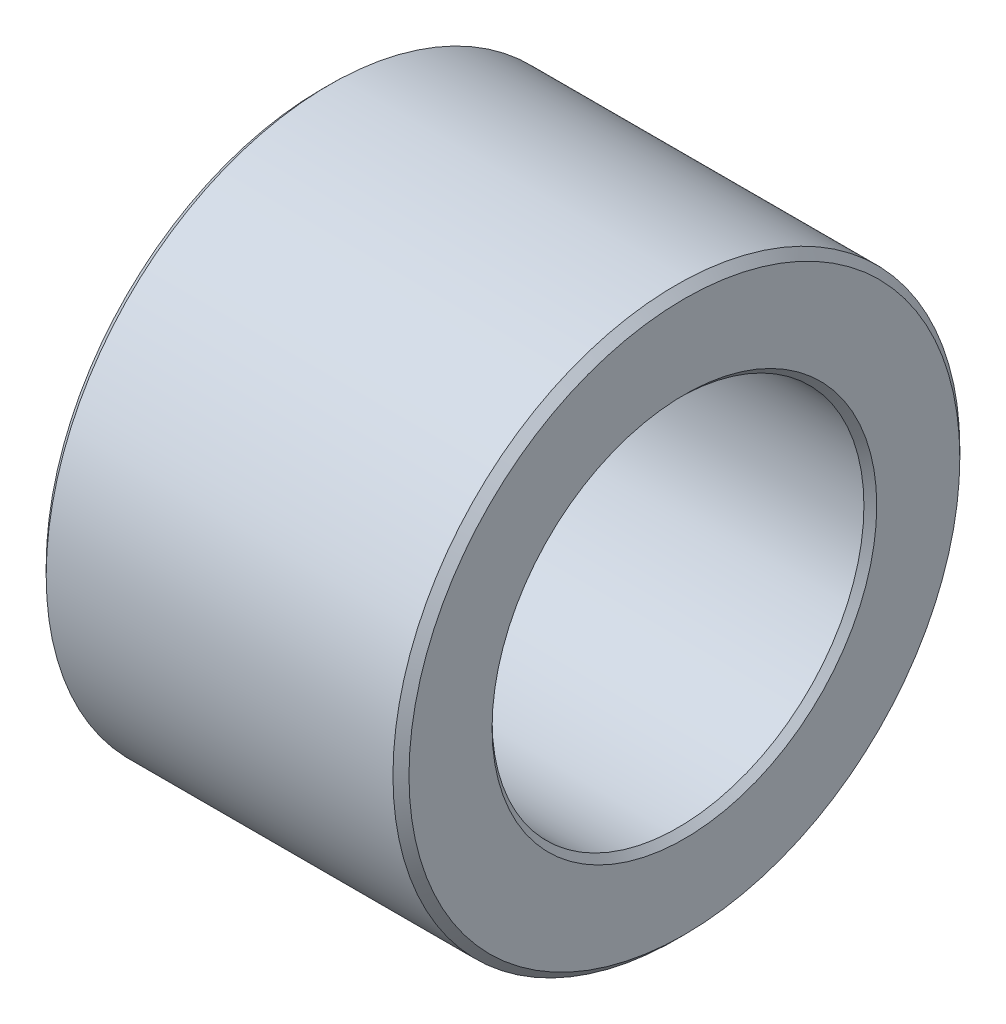
ISO-10303-21;
HEADER;
FILE_DESCRIPTION(('STEP AP214'),'2;1');
FILE_NAME('part.step','',(''),(''),'','','');
FILE_SCHEMA(('AUTOMOTIVE_DESIGN { 1 0 10303 214 1 1 1 1 }'));
ENDSEC;
DATA;
#1=APPLICATION_CONTEXT('core data for automotive mechanical design processes');
#2=APPLICATION_PROTOCOL_DEFINITION('international standard','automotive_design',2000,#1);
#3=PRODUCT_CONTEXT('',#1,'mechanical');
#4=PRODUCT('Part','Part','',(#3));
#5=PRODUCT_RELATED_PRODUCT_CATEGORY('part','',(#4));
#6=PRODUCT_DEFINITION_FORMATION('','',#4);
#7=PRODUCT_DEFINITION_CONTEXT('part definition',#1,'design');
#8=PRODUCT_DEFINITION('design','',#6,#7);
#9=PRODUCT_DEFINITION_SHAPE('','',#8);
#10=(LENGTH_UNIT() NAMED_UNIT(*) SI_UNIT(.MILLI.,.METRE.));
#11=(NAMED_UNIT(*) PLANE_ANGLE_UNIT() SI_UNIT($,.RADIAN.));
#12=(NAMED_UNIT(*) SI_UNIT($,.STERADIAN.) SOLID_ANGLE_UNIT());
#13=UNCERTAINTY_MEASURE_WITH_UNIT(LENGTH_MEASURE(1.E-05),#10,'distance_accuracy_value','');
#14=(GEOMETRIC_REPRESENTATION_CONTEXT(3) GLOBAL_UNCERTAINTY_ASSIGNED_CONTEXT((#13)) GLOBAL_UNIT_ASSIGNED_CONTEXT((#10,
#11,#12)) REPRESENTATION_CONTEXT('',''));
#15=CARTESIAN_POINT('',(0.,0.,0.));
#16=DIRECTION('',(0.,0.,1.));
#17=DIRECTION('',(1.,0.,0.));
#18=AXIS2_PLACEMENT_3D('',#15,#16,#17);
#19=CARTESIAN_POINT('',(50.,0.,0.));
#20=DIRECTION('',(-1.,0.,0.));
#21=DIRECTION('',(0.,0.,1.));
#22=AXIS2_PLACEMENT_3D('',#19,#20,#21);
#23=CYLINDRICAL_SURFACE('',#22,4.1);
#24=CARTESIAN_POINT('',(0.176776695354874,0.,0.));
#25=DIRECTION('',(-1.,0.,0.));
#26=DIRECTION('',(0.,0.,1.));
#27=AXIS2_PLACEMENT_3D('',#24,#25,#26);
#28=CIRCLE('',#27,4.099999999994);
#29=CARTESIAN_POINT('',(0.176776695354874,0.,4.099999999994));
#30=VERTEX_POINT('',#29);
#31=EDGE_CURVE('E38',#30,#30,#28,.T.);
#32=ORIENTED_EDGE('',*,*,#31,.T.);
#33=EDGE_LOOP('',(#32));
#34=FACE_BOUND('',#33,.T.);
#35=CARTESIAN_POINT('',(7.85857864383388,0.,0.));
#36=DIRECTION('',(1.,0.,0.));
#37=DIRECTION('',(0.,0.,-1.));
#38=AXIS2_PLACEMENT_3D('',#35,#36,#37);
#39=CIRCLE('',#38,4.099999999994);
#40=CARTESIAN_POINT('',(7.85857864383388,0.,-4.099999999994));
#41=VERTEX_POINT('',#40);
#42=EDGE_CURVE('E34',#41,#41,#39,.T.);
#43=ORIENTED_EDGE('',*,*,#42,.T.);
#44=EDGE_LOOP('',(#43));
#45=FACE_BOUND('',#44,.T.);
#46=ADVANCED_FACE('F15',(#34,#45),#23,.F.);
#47=CARTESIAN_POINT('',(1.13686837721616E-10,0.,0.));
#48=DIRECTION('',(-1.,0.,0.));
#49=DIRECTION('',(0.,0.,1.));
#50=AXIS2_PLACEMENT_3D('',#47,#48,#49);
#51=CONICAL_SURFACE('',#50,4.27677669523518,0.785398163397448);
#52=CARTESIAN_POINT('',(5.6843418860808E-11,0.,0.));
#53=DIRECTION('',(-1.,0.,0.));
#54=DIRECTION('',(0.,0.,1.));
#55=AXIS2_PLACEMENT_3D('',#52,#53,#54);
#56=CIRCLE('',#55,4.27677669529203);
#57=CARTESIAN_POINT('',(5.6843418860808E-11,0.,4.27677669529203));
#58=VERTEX_POINT('',#57);
#59=EDGE_CURVE('E37',#58,#58,#56,.F.);
#60=ORIENTED_EDGE('',*,*,#59,.F.);
#61=EDGE_LOOP('',(#60));
#62=FACE_BOUND('',#61,.T.);
#63=ORIENTED_EDGE('',*,*,#31,.F.);
#64=EDGE_LOOP('',(#63));
#65=FACE_BOUND('',#64,.T.);
#66=ADVANCED_FACE('F63',(#62,#65),#51,.F.);
#67=CARTESIAN_POINT('',(8.0000000000382,0.,0.));
#68=DIRECTION('',(1.,0.,0.));
#69=DIRECTION('',(0.,0.,-1.));
#70=AXIS2_PLACEMENT_3D('',#67,#68,#69);
#71=CONICAL_SURFACE('',#70,4.24142135619832,0.785398163397448);
#72=ORIENTED_EDGE('',*,*,#42,.F.);
#73=EDGE_LOOP('',(#72));
#74=FACE_BOUND('',#73,.T.);
#75=CARTESIAN_POINT('',(8.0000000000382,0.,0.));
#76=DIRECTION('',(1.,0.,0.));
#77=DIRECTION('',(0.,0.,-1.));
#78=AXIS2_PLACEMENT_3D('',#75,#76,#77);
#79=CIRCLE('',#78,4.24142135619832);
#80=CARTESIAN_POINT('',(8.0000000000382,0.,-4.24142135619832));
#81=VERTEX_POINT('',#80);
#82=EDGE_CURVE('E52',#81,#81,#79,.F.);
#83=ORIENTED_EDGE('',*,*,#82,.F.);
#84=EDGE_LOOP('',(#83));
#85=FACE_BOUND('',#84,.T.);
#86=ADVANCED_FACE('F66',(#74,#85),#71,.F.);
#87=CARTESIAN_POINT('',(0.,6.07322330470336,0.));
#88=DIRECTION('',(-1.,0.,0.));
#89=DIRECTION('',(0.,0.,1.));
#90=AXIS2_PLACEMENT_3D('',#87,#88,#89);
#91=PLANE('',#90);
#92=CARTESIAN_POINT('',(-5.6843418860808E-11,0.,0.));
#93=DIRECTION('',(1.,0.,0.));
#94=DIRECTION('',(0.,0.,-1.));
#95=AXIS2_PLACEMENT_3D('',#92,#93,#94);
#96=CIRCLE('',#95,6.07322330466786);
#97=CARTESIAN_POINT('',(-5.6843418860808E-11,0.,-6.07322330466786));
#98=VERTEX_POINT('',#97);
#99=EDGE_CURVE('E47',#98,#98,#96,.T.);
#100=ORIENTED_EDGE('',*,*,#99,.F.);
#101=EDGE_LOOP('',(#100));
#102=FACE_BOUND('',#101,.T.);
#103=ORIENTED_EDGE('',*,*,#59,.T.);
#104=EDGE_LOOP('',(#103));
#105=FACE_BOUND('',#104,.T.);
#106=ADVANCED_FACE('F61',(#102,#105),#91,.T.);
#107=CARTESIAN_POINT('',(8.,4.24142135623732,0.));
#108=DIRECTION('',(1.,0.,0.));
#109=DIRECTION('',(0.,0.,-1.));
#110=AXIS2_PLACEMENT_3D('',#107,#108,#109);
#111=PLANE('',#110);
#112=ORIENTED_EDGE('',*,*,#82,.T.);
#113=EDGE_LOOP('',(#112));
#114=FACE_BOUND('',#113,.T.);
#115=CARTESIAN_POINT('',(7.99999999998136,0.,0.));
#116=DIRECTION('',(-1.,0.,0.));
#117=DIRECTION('',(0.,0.,1.));
#118=AXIS2_PLACEMENT_3D('',#115,#116,#117);
#119=CIRCLE('',#118,6.07322330466786);
#120=CARTESIAN_POINT('',(7.99999999998136,0.,6.07322330466786));
#121=VERTEX_POINT('',#120);
#122=EDGE_CURVE('E27',#121,#121,#119,.T.);
#123=ORIENTED_EDGE('',*,*,#122,.F.);
#124=EDGE_LOOP('',(#123));
#125=FACE_BOUND('',#124,.T.);
#126=ADVANCED_FACE('F78',(#114,#125),#111,.T.);
#127=CARTESIAN_POINT('',(0.176776695298031,0.,0.));
#128=DIRECTION('',(1.,0.,0.));
#129=DIRECTION('',(0.,0.,-1.));
#130=AXIS2_PLACEMENT_3D('',#127,#128,#129);
#131=CONICAL_SURFACE('',#130,6.25000000002274,0.785398163397448);
#132=CARTESIAN_POINT('',(0.176776695296636,0.,0.));
#133=DIRECTION('',(-1.,0.,0.));
#134=DIRECTION('',(0.,0.,1.));
#135=AXIS2_PLACEMENT_3D('',#132,#133,#134);
#136=CIRCLE('',#135,6.25);
#137=CARTESIAN_POINT('',(0.176776695296636,0.,6.25));
#138=VERTEX_POINT('',#137);
#139=EDGE_CURVE('E22',#138,#138,#136,.F.);
#140=ORIENTED_EDGE('',*,*,#139,.F.);
#141=EDGE_LOOP('',(#140));
#142=FACE_BOUND('',#141,.T.);
#143=ORIENTED_EDGE('',*,*,#99,.T.);
#144=EDGE_LOOP('',(#143));
#145=FACE_BOUND('',#144,.T.);
#146=ADVANCED_FACE('F81',(#142,#145),#131,.T.);
#147=CARTESIAN_POINT('',(7.82322330456964,0.,0.));
#148=DIRECTION('',(-1.,0.,0.));
#149=DIRECTION('',(0.,0.,1.));
#150=AXIS2_PLACEMENT_3D('',#147,#148,#149);
#151=CONICAL_SURFACE('',#150,6.25000000007958,0.785398163397448);
#152=ORIENTED_EDGE('',*,*,#122,.T.);
#153=EDGE_LOOP('',(#152));
#154=FACE_BOUND('',#153,.T.);
#155=CARTESIAN_POINT('',(7.82322330470336,0.,0.));
#156=DIRECTION('',(-1.,0.,0.));
#157=DIRECTION('',(0.,0.,1.));
#158=AXIS2_PLACEMENT_3D('',#155,#156,#157);
#159=CIRCLE('',#158,6.25);
#160=CARTESIAN_POINT('',(7.82322330470336,0.,6.25));
#161=VERTEX_POINT('',#160);
#162=EDGE_CURVE('E10',#161,#161,#159,.T.);
#163=ORIENTED_EDGE('',*,*,#162,.F.);
#164=EDGE_LOOP('',(#163));
#165=FACE_BOUND('',#164,.T.);
#166=ADVANCED_FACE('F85',(#154,#165),#151,.T.);
#167=CARTESIAN_POINT('',(50.,0.,0.));
#168=DIRECTION('',(-1.,0.,0.));
#169=DIRECTION('',(0.,0.,1.));
#170=AXIS2_PLACEMENT_3D('',#167,#168,#169);
#171=CYLINDRICAL_SURFACE('',#170,6.25);
#172=ORIENTED_EDGE('',*,*,#162,.T.);
#173=EDGE_LOOP('',(#172));
#174=FACE_BOUND('',#173,.T.);
#175=ORIENTED_EDGE('',*,*,#139,.T.);
#176=EDGE_LOOP('',(#175));
#177=FACE_BOUND('',#176,.T.);
#178=ADVANCED_FACE('F88',(#174,#177),#171,.T.);
#179=CLOSED_SHELL('',(#46,#66,#86,#106,#126,#146,#166,#178));
#180=MANIFOLD_SOLID_BREP('B1',#179);
#181=ADVANCED_BREP_SHAPE_REPRESENTATION('',(#18,#180),#14);
#182=SHAPE_DEFINITION_REPRESENTATION(#9,#181);
ENDSEC;
END-ISO-10303-21;
